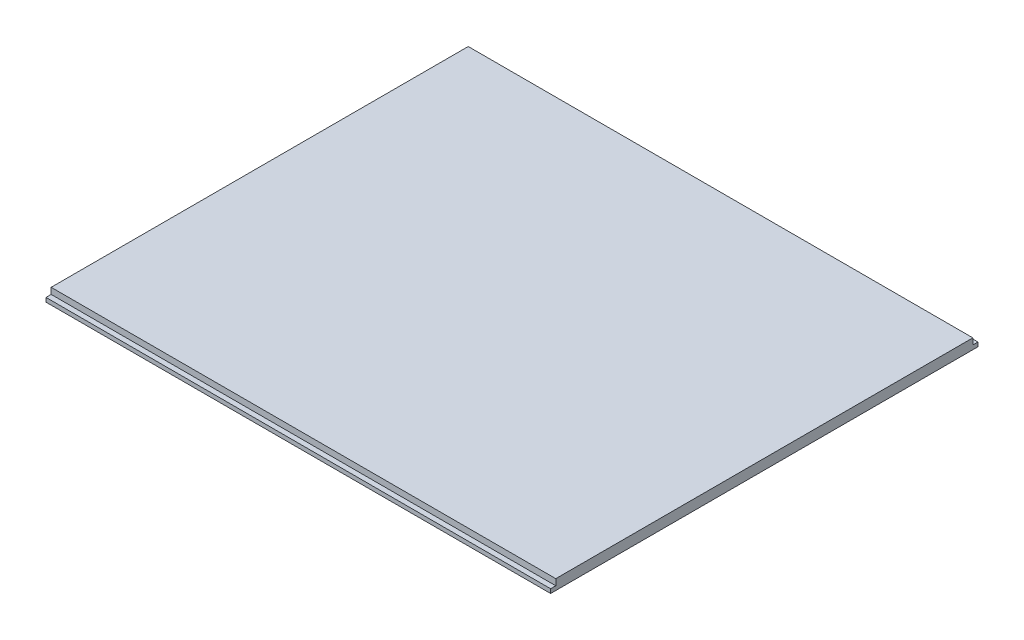
ISO-10303-21;
HEADER;
FILE_DESCRIPTION(('STEP AP214'),'2;1');
FILE_NAME('part.step','',(''),(''),'','','');
FILE_SCHEMA(('AUTOMOTIVE_DESIGN { 1 0 10303 214 1 1 1 1 }'));
ENDSEC;
DATA;
#1=APPLICATION_CONTEXT('core data for automotive mechanical design processes');
#2=APPLICATION_PROTOCOL_DEFINITION('international standard','automotive_design',2000,#1);
#3=PRODUCT_CONTEXT('',#1,'mechanical');
#4=PRODUCT('Part','Part','',(#3));
#5=PRODUCT_RELATED_PRODUCT_CATEGORY('part','',(#4));
#6=PRODUCT_DEFINITION_FORMATION('','',#4);
#7=PRODUCT_DEFINITION_CONTEXT('part definition',#1,'design');
#8=PRODUCT_DEFINITION('design','',#6,#7);
#9=PRODUCT_DEFINITION_SHAPE('','',#8);
#10=(LENGTH_UNIT() NAMED_UNIT(*) SI_UNIT(.MILLI.,.METRE.));
#11=(NAMED_UNIT(*) PLANE_ANGLE_UNIT() SI_UNIT($,.RADIAN.));
#12=(NAMED_UNIT(*) SI_UNIT($,.STERADIAN.) SOLID_ANGLE_UNIT());
#13=UNCERTAINTY_MEASURE_WITH_UNIT(LENGTH_MEASURE(1.E-05),#10,'distance_accuracy_value','');
#14=(GEOMETRIC_REPRESENTATION_CONTEXT(3) GLOBAL_UNCERTAINTY_ASSIGNED_CONTEXT((#13)) GLOBAL_UNIT_ASSIGNED_CONTEXT((#10,
#11,#12)) REPRESENTATION_CONTEXT('',''));
#15=CARTESIAN_POINT('',(0.,0.,0.));
#16=DIRECTION('',(0.,0.,1.));
#17=DIRECTION('',(1.,0.,0.));
#18=AXIS2_PLACEMENT_3D('',#15,#16,#17);
#19=CARTESIAN_POINT('',(0.,2.,-83.));
#20=DIRECTION('',(0.,0.,1.));
#21=DIRECTION('',(1.,0.,0.));
#22=AXIS2_PLACEMENT_3D('',#19,#20,#21);
#23=PLANE('',#22);
#24=DIRECTION('',(-1.,0.,0.));
#25=VECTOR('',#24,1.);
#26=CARTESIAN_POINT('',(0.,0.8,-83.));
#27=LINE('',#26,#25);
#28=CARTESIAN_POINT('',(98.,0.8,-83.));
#29=VERTEX_POINT('',#28);
#30=CARTESIAN_POINT('',(0.,0.8,-83.));
#31=VERTEX_POINT('',#30);
#32=EDGE_CURVE('E167',#29,#31,#27,.T.);
#33=ORIENTED_EDGE('',*,*,#32,.F.);
#34=DIRECTION('',(0.,-1.,0.));
#35=VECTOR('',#34,1.);
#36=CARTESIAN_POINT('',(98.,2.,-83.));
#37=LINE('',#36,#35);
#38=CARTESIAN_POINT('',(98.,0.,-83.));
#39=VERTEX_POINT('',#38);
#40=EDGE_CURVE('E156',#29,#39,#37,.T.);
#41=ORIENTED_EDGE('',*,*,#40,.T.);
#42=DIRECTION('',(-1.,0.,0.));
#43=VECTOR('',#42,1.);
#44=CARTESIAN_POINT('',(0.,0.,-83.));
#45=LINE('',#44,#43);
#46=CARTESIAN_POINT('',(0.,0.,-83.));
#47=VERTEX_POINT('',#46);
#48=EDGE_CURVE('E150',#39,#47,#45,.T.);
#49=ORIENTED_EDGE('',*,*,#48,.T.);
#50=DIRECTION('',(0.,-1.,0.));
#51=VECTOR('',#50,1.);
#52=CARTESIAN_POINT('',(0.,2.,-83.));
#53=LINE('',#52,#51);
#54=EDGE_CURVE('E130',#31,#47,#53,.T.);
#55=ORIENTED_EDGE('',*,*,#54,.F.);
#56=EDGE_LOOP('',(#33,#41,#49,#55));
#57=FACE_BOUND('',#56,.T.);
#58=ADVANCED_FACE('F39',(#57),#23,.F.);
#59=CARTESIAN_POINT('',(0.,2.,0.));
#60=DIRECTION('',(1.,0.,0.));
#61=DIRECTION('',(0.,0.,-1.));
#62=AXIS2_PLACEMENT_3D('',#59,#60,#61);
#63=PLANE('',#62);
#64=DIRECTION('',(0.,0.,1.));
#65=VECTOR('',#64,1.);
#66=CARTESIAN_POINT('',(0.,0.8,0.));
#67=LINE('',#66,#65);
#68=CARTESIAN_POINT('',(0.,0.8,-1.));
#69=VERTEX_POINT('',#68);
#70=CARTESIAN_POINT('',(0.,0.8,0.));
#71=VERTEX_POINT('',#70);
#72=EDGE_CURVE('E105',#69,#71,#67,.T.);
#73=ORIENTED_EDGE('',*,*,#72,.F.);
#74=DIRECTION('',(0.,1.,0.));
#75=VECTOR('',#74,1.);
#76=CARTESIAN_POINT('',(0.,0.8,-1.));
#77=LINE('',#76,#75);
#78=CARTESIAN_POINT('',(0.,2.,-1.));
#79=VERTEX_POINT('',#78);
#80=EDGE_CURVE('E136',#69,#79,#77,.T.);
#81=ORIENTED_EDGE('',*,*,#80,.T.);
#82=DIRECTION('',(0.,0.,1.));
#83=VECTOR('',#82,1.);
#84=CARTESIAN_POINT('',(0.,2.,0.));
#85=LINE('',#84,#83);
#86=CARTESIAN_POINT('',(0.,2.,-82.));
#87=VERTEX_POINT('',#86);
#88=EDGE_CURVE('E153',#87,#79,#85,.T.);
#89=ORIENTED_EDGE('',*,*,#88,.F.);
#90=DIRECTION('',(0.,1.,0.));
#91=VECTOR('',#90,1.);
#92=CARTESIAN_POINT('',(0.,0.8,-82.));
#93=LINE('',#92,#91);
#94=CARTESIAN_POINT('',(0.,0.8,-82.));
#95=VERTEX_POINT('',#94);
#96=EDGE_CURVE('E63',#95,#87,#93,.T.);
#97=ORIENTED_EDGE('',*,*,#96,.F.);
#98=DIRECTION('',(0.,0.,1.));
#99=VECTOR('',#98,1.);
#100=CARTESIAN_POINT('',(0.,0.8,-83.));
#101=LINE('',#100,#99);
#102=EDGE_CURVE('E181',#31,#95,#101,.T.);
#103=ORIENTED_EDGE('',*,*,#102,.F.);
#104=ORIENTED_EDGE('',*,*,#54,.T.);
#105=DIRECTION('',(0.,0.,1.));
#106=VECTOR('',#105,1.);
#107=CARTESIAN_POINT('',(0.,0.,0.));
#108=LINE('',#107,#106);
#109=CARTESIAN_POINT('',(0.,0.,0.));
#110=VERTEX_POINT('',#109);
#111=EDGE_CURVE('E127',#47,#110,#108,.T.);
#112=ORIENTED_EDGE('',*,*,#111,.T.);
#113=DIRECTION('',(0.,-1.,0.));
#114=VECTOR('',#113,1.);
#115=CARTESIAN_POINT('',(0.,2.,0.));
#116=LINE('',#115,#114);
#117=EDGE_CURVE('E11',#71,#110,#116,.T.);
#118=ORIENTED_EDGE('',*,*,#117,.F.);
#119=EDGE_LOOP('',(#73,#81,#89,#97,#103,#104,#112,#118));
#120=FACE_BOUND('',#119,.T.);
#121=ADVANCED_FACE('F41',(#120),#63,.F.);
#122=CARTESIAN_POINT('',(0.,2.,0.));
#123=DIRECTION('',(0.,0.,-1.));
#124=DIRECTION('',(-1.,0.,0.));
#125=AXIS2_PLACEMENT_3D('',#122,#123,#124);
#126=PLANE('',#125);
#127=DIRECTION('',(0.,-1.,0.));
#128=VECTOR('',#127,1.);
#129=CARTESIAN_POINT('',(98.,2.,0.));
#130=LINE('',#129,#128);
#131=CARTESIAN_POINT('',(98.,0.8,0.));
#132=VERTEX_POINT('',#131);
#133=CARTESIAN_POINT('',(98.,0.,0.));
#134=VERTEX_POINT('',#133);
#135=EDGE_CURVE('E48',#132,#134,#130,.T.);
#136=ORIENTED_EDGE('',*,*,#135,.F.);
#137=DIRECTION('',(1.,0.,0.));
#138=VECTOR('',#137,1.);
#139=CARTESIAN_POINT('',(0.,0.8,0.));
#140=LINE('',#139,#138);
#141=EDGE_CURVE('E108',#71,#132,#140,.T.);
#142=ORIENTED_EDGE('',*,*,#141,.F.);
#143=ORIENTED_EDGE('',*,*,#117,.T.);
#144=DIRECTION('',(1.,0.,0.));
#145=VECTOR('',#144,1.);
#146=CARTESIAN_POINT('',(0.,0.,0.));
#147=LINE('',#146,#145);
#148=EDGE_CURVE('E135',#110,#134,#147,.T.);
#149=ORIENTED_EDGE('',*,*,#148,.T.);
#150=EDGE_LOOP('',(#136,#142,#143,#149));
#151=FACE_BOUND('',#150,.T.);
#152=ADVANCED_FACE('F119',(#151),#126,.F.);
#153=CARTESIAN_POINT('',(98.,2.,0.));
#154=DIRECTION('',(-1.,0.,0.));
#155=DIRECTION('',(0.,0.,1.));
#156=AXIS2_PLACEMENT_3D('',#153,#154,#155);
#157=PLANE('',#156);
#158=DIRECTION('',(0.,0.,-1.));
#159=VECTOR('',#158,1.);
#160=CARTESIAN_POINT('',(98.,2.,0.));
#161=LINE('',#160,#159);
#162=CARTESIAN_POINT('',(98.,2.,-1.));
#163=VERTEX_POINT('',#162);
#164=CARTESIAN_POINT('',(98.,2.,-82.));
#165=VERTEX_POINT('',#164);
#166=EDGE_CURVE('E144',#163,#165,#161,.T.);
#167=ORIENTED_EDGE('',*,*,#166,.F.);
#168=DIRECTION('',(0.,1.,0.));
#169=VECTOR('',#168,1.);
#170=CARTESIAN_POINT('',(98.,0.8,-1.));
#171=LINE('',#170,#169);
#172=CARTESIAN_POINT('',(98.,0.8,-1.));
#173=VERTEX_POINT('',#172);
#174=EDGE_CURVE('E55',#173,#163,#171,.T.);
#175=ORIENTED_EDGE('',*,*,#174,.F.);
#176=DIRECTION('',(0.,0.,-1.));
#177=VECTOR('',#176,1.);
#178=CARTESIAN_POINT('',(98.,0.8,0.));
#179=LINE('',#178,#177);
#180=EDGE_CURVE('E123',#132,#173,#179,.T.);
#181=ORIENTED_EDGE('',*,*,#180,.F.);
#182=ORIENTED_EDGE('',*,*,#135,.T.);
#183=DIRECTION('',(0.,0.,-1.));
#184=VECTOR('',#183,1.);
#185=CARTESIAN_POINT('',(98.,0.,0.));
#186=LINE('',#185,#184);
#187=EDGE_CURVE('E140',#134,#39,#186,.T.);
#188=ORIENTED_EDGE('',*,*,#187,.T.);
#189=ORIENTED_EDGE('',*,*,#40,.F.);
#190=DIRECTION('',(0.,0.,-1.));
#191=VECTOR('',#190,1.);
#192=CARTESIAN_POINT('',(98.,0.8,-83.));
#193=LINE('',#192,#191);
#194=CARTESIAN_POINT('',(98.,0.8,-82.));
#195=VERTEX_POINT('',#194);
#196=EDGE_CURVE('E170',#195,#29,#193,.T.);
#197=ORIENTED_EDGE('',*,*,#196,.F.);
#198=DIRECTION('',(0.,1.,0.));
#199=VECTOR('',#198,1.);
#200=CARTESIAN_POINT('',(98.,0.8,-82.));
#201=LINE('',#200,#199);
#202=EDGE_CURVE('E171',#195,#165,#201,.T.);
#203=ORIENTED_EDGE('',*,*,#202,.T.);
#204=EDGE_LOOP('',(#167,#175,#181,#182,#188,#189,#197,#203));
#205=FACE_BOUND('',#204,.T.);
#206=ADVANCED_FACE('F161',(#205),#157,.F.);
#207=CARTESIAN_POINT('',(0.,2.,0.));
#208=DIRECTION('',(0.,-1.,0.));
#209=DIRECTION('',(0.,0.,-1.));
#210=AXIS2_PLACEMENT_3D('',#207,#208,#209);
#211=PLANE('',#210);
#212=ORIENTED_EDGE('',*,*,#88,.T.);
#213=DIRECTION('',(-1.,0.,0.));
#214=VECTOR('',#213,1.);
#215=CARTESIAN_POINT('',(0.,2.,-1.));
#216=LINE('',#215,#214);
#217=EDGE_CURVE('E115',#163,#79,#216,.T.);
#218=ORIENTED_EDGE('',*,*,#217,.F.);
#219=ORIENTED_EDGE('',*,*,#166,.T.);
#220=DIRECTION('',(1.,0.,0.));
#221=VECTOR('',#220,1.);
#222=CARTESIAN_POINT('',(0.,2.,-82.));
#223=LINE('',#222,#221);
#224=EDGE_CURVE('E185',#87,#165,#223,.T.);
#225=ORIENTED_EDGE('',*,*,#224,.F.);
#226=EDGE_LOOP('',(#212,#218,#219,#225));
#227=FACE_BOUND('',#226,.T.);
#228=ADVANCED_FACE('F196',(#227),#211,.F.);
#229=CARTESIAN_POINT('',(0.,0.,0.));
#230=DIRECTION('',(0.,-1.,0.));
#231=DIRECTION('',(0.,0.,-1.));
#232=AXIS2_PLACEMENT_3D('',#229,#230,#231);
#233=PLANE('',#232);
#234=ORIENTED_EDGE('',*,*,#111,.F.);
#235=ORIENTED_EDGE('',*,*,#48,.F.);
#236=ORIENTED_EDGE('',*,*,#187,.F.);
#237=ORIENTED_EDGE('',*,*,#148,.F.);
#238=EDGE_LOOP('',(#234,#235,#236,#237));
#239=FACE_BOUND('',#238,.T.);
#240=ADVANCED_FACE('F164',(#239),#233,.T.);
#241=CARTESIAN_POINT('',(0.,0.8,-82.));
#242=DIRECTION('',(0.,0.,1.));
#243=DIRECTION('',(1.,0.,0.));
#244=AXIS2_PLACEMENT_3D('',#241,#242,#243);
#245=PLANE('',#244);
#246=ORIENTED_EDGE('',*,*,#224,.T.);
#247=ORIENTED_EDGE('',*,*,#202,.F.);
#248=DIRECTION('',(1.,0.,0.));
#249=VECTOR('',#248,1.);
#250=CARTESIAN_POINT('',(0.,0.8,-82.));
#251=LINE('',#250,#249);
#252=EDGE_CURVE('E176',#95,#195,#251,.T.);
#253=ORIENTED_EDGE('',*,*,#252,.F.);
#254=ORIENTED_EDGE('',*,*,#96,.T.);
#255=EDGE_LOOP('',(#246,#247,#253,#254));
#256=FACE_BOUND('',#255,.T.);
#257=ADVANCED_FACE('F216',(#256),#245,.F.);
#258=CARTESIAN_POINT('',(0.,0.8,0.));
#259=DIRECTION('',(0.,1.,0.));
#260=DIRECTION('',(0.,0.,1.));
#261=AXIS2_PLACEMENT_3D('',#258,#259,#260);
#262=PLANE('',#261);
#263=ORIENTED_EDGE('',*,*,#102,.T.);
#264=ORIENTED_EDGE('',*,*,#252,.T.);
#265=ORIENTED_EDGE('',*,*,#196,.T.);
#266=ORIENTED_EDGE('',*,*,#32,.T.);
#267=EDGE_LOOP('',(#263,#264,#265,#266));
#268=FACE_BOUND('',#267,.T.);
#269=ADVANCED_FACE('F204',(#268),#262,.T.);
#270=CARTESIAN_POINT('',(0.,0.8,-1.));
#271=DIRECTION('',(0.,0.,-1.));
#272=DIRECTION('',(-1.,0.,0.));
#273=AXIS2_PLACEMENT_3D('',#270,#271,#272);
#274=PLANE('',#273);
#275=ORIENTED_EDGE('',*,*,#217,.T.);
#276=ORIENTED_EDGE('',*,*,#80,.F.);
#277=DIRECTION('',(-1.,0.,0.));
#278=VECTOR('',#277,1.);
#279=CARTESIAN_POINT('',(0.,0.8,-1.));
#280=LINE('',#279,#278);
#281=EDGE_CURVE('E110',#173,#69,#280,.T.);
#282=ORIENTED_EDGE('',*,*,#281,.F.);
#283=ORIENTED_EDGE('',*,*,#174,.T.);
#284=EDGE_LOOP('',(#275,#276,#282,#283));
#285=FACE_BOUND('',#284,.T.);
#286=ADVANCED_FACE('F205',(#285),#274,.F.);
#287=CARTESIAN_POINT('',(0.,0.8,0.));
#288=DIRECTION('',(0.,-1.,0.));
#289=DIRECTION('',(0.,0.,-1.));
#290=AXIS2_PLACEMENT_3D('',#287,#288,#289);
#291=PLANE('',#290);
#292=ORIENTED_EDGE('',*,*,#72,.T.);
#293=ORIENTED_EDGE('',*,*,#141,.T.);
#294=ORIENTED_EDGE('',*,*,#180,.T.);
#295=ORIENTED_EDGE('',*,*,#281,.T.);
#296=EDGE_LOOP('',(#292,#293,#294,#295));
#297=FACE_BOUND('',#296,.T.);
#298=ADVANCED_FACE('F107',(#297),#291,.F.);
#299=CLOSED_SHELL('',(#58,#121,#152,#206,#228,#240,#257,#269,#286,#298));
#300=MANIFOLD_SOLID_BREP('B2',#299);
#301=ADVANCED_BREP_SHAPE_REPRESENTATION('',(#18,#300),#14);
#302=SHAPE_DEFINITION_REPRESENTATION(#9,#301);
ENDSEC;
END-ISO-10303-21;
